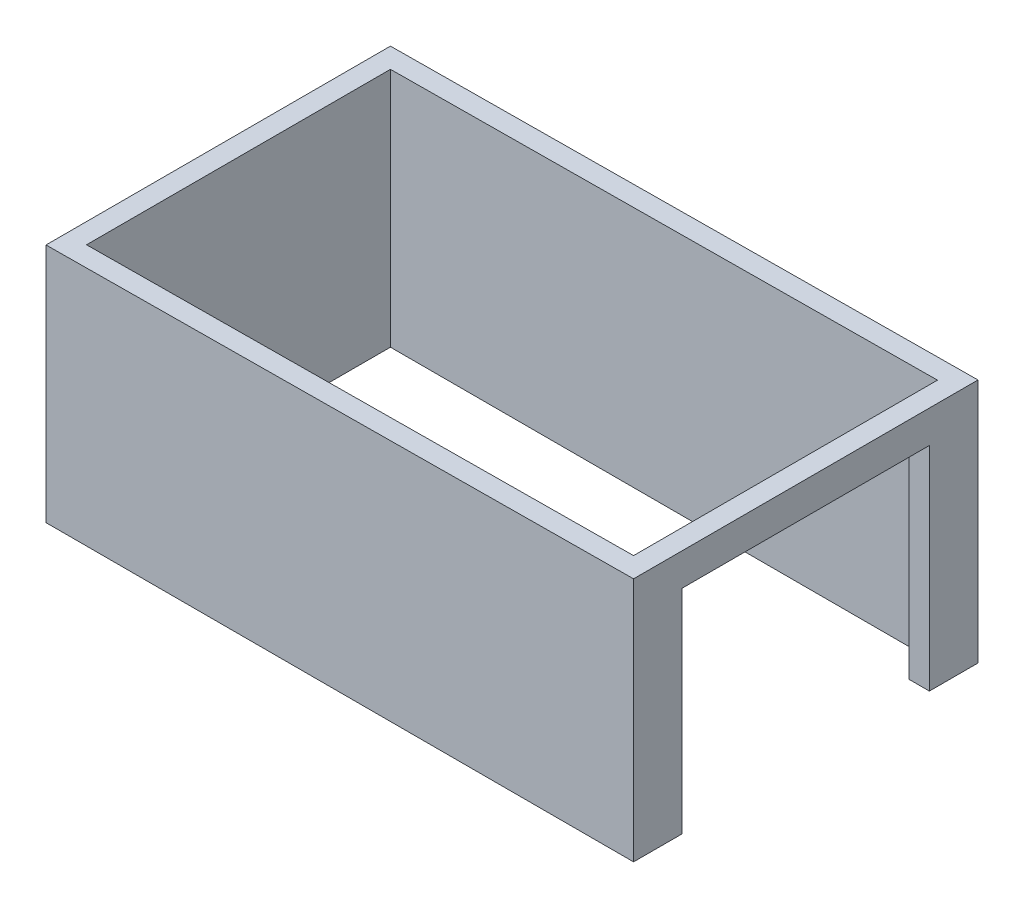
ISO-10303-21;
HEADER;
FILE_DESCRIPTION(('STEP AP214'),'2;1');
FILE_NAME('part.step','',(''),(''),'','','');
FILE_SCHEMA(('AUTOMOTIVE_DESIGN { 1 0 10303 214 1 1 1 1 }'));
ENDSEC;
DATA;
#1=APPLICATION_CONTEXT('core data for automotive mechanical design processes');
#2=APPLICATION_PROTOCOL_DEFINITION('international standard','automotive_design',2000,#1);
#3=PRODUCT_CONTEXT('',#1,'mechanical');
#4=PRODUCT('Part','Part','',(#3));
#5=PRODUCT_RELATED_PRODUCT_CATEGORY('part','',(#4));
#6=PRODUCT_DEFINITION_FORMATION('','',#4);
#7=PRODUCT_DEFINITION_CONTEXT('part definition',#1,'design');
#8=PRODUCT_DEFINITION('design','',#6,#7);
#9=PRODUCT_DEFINITION_SHAPE('','',#8);
#10=(LENGTH_UNIT() NAMED_UNIT(*) SI_UNIT(.MILLI.,.METRE.));
#11=(NAMED_UNIT(*) PLANE_ANGLE_UNIT() SI_UNIT($,.RADIAN.));
#12=(NAMED_UNIT(*) SI_UNIT($,.STERADIAN.) SOLID_ANGLE_UNIT());
#13=UNCERTAINTY_MEASURE_WITH_UNIT(LENGTH_MEASURE(1.E-05),#10,'distance_accuracy_value','');
#14=(GEOMETRIC_REPRESENTATION_CONTEXT(3) GLOBAL_UNCERTAINTY_ASSIGNED_CONTEXT((#13)) GLOBAL_UNIT_ASSIGNED_CONTEXT((#10,
#11,#12)) REPRESENTATION_CONTEXT('',''));
#15=CARTESIAN_POINT('',(0.,0.,0.));
#16=DIRECTION('',(0.,0.,1.));
#17=DIRECTION('',(1.,0.,0.));
#18=AXIS2_PLACEMENT_3D('',#15,#16,#17);
#19=CARTESIAN_POINT('',(0.,0.,0.));
#20=DIRECTION('',(0.,1.,0.));
#21=DIRECTION('',(0.,0.,1.));
#22=AXIS2_PLACEMENT_3D('',#19,#20,#21);
#23=PLANE('',#22);
#24=DIRECTION('',(0.,0.,-1.));
#25=VECTOR('',#24,1.);
#26=CARTESIAN_POINT('',(5600.,0.,0.));
#27=LINE('',#26,#25);
#28=CARTESIAN_POINT('',(5600.,0.,-2720.));
#29=VERTEX_POINT('',#28);
#30=CARTESIAN_POINT('',(5600.,0.,-3200.));
#31=VERTEX_POINT('',#30);
#32=EDGE_CURVE('E183',#29,#31,#27,.T.);
#33=ORIENTED_EDGE('',*,*,#32,.F.);
#34=DIRECTION('',(1.,0.,0.));
#35=VECTOR('',#34,1.);
#36=CARTESIAN_POINT('',(-200.001,0.,-2720.));
#37=LINE('',#36,#35);
#38=CARTESIAN_POINT('',(5400.,0.,-2720.));
#39=VERTEX_POINT('',#38);
#40=EDGE_CURVE('E211',#39,#29,#37,.T.);
#41=ORIENTED_EDGE('',*,*,#40,.F.);
#42=DIRECTION('',(0.,0.,-1.));
#43=VECTOR('',#42,1.);
#44=CARTESIAN_POINT('',(5400.,0.,0.));
#45=LINE('',#44,#43);
#46=CARTESIAN_POINT('',(5400.,0.,-3000.));
#47=VERTEX_POINT('',#46);
#48=EDGE_CURVE('E202',#39,#47,#45,.T.);
#49=ORIENTED_EDGE('',*,*,#48,.T.);
#50=DIRECTION('',(-1.,0.,0.));
#51=VECTOR('',#50,1.);
#52=CARTESIAN_POINT('',(0.,0.,-3000.));
#53=LINE('',#52,#51);
#54=CARTESIAN_POINT('',(0.,0.,-3000.));
#55=VERTEX_POINT('',#54);
#56=EDGE_CURVE('E196',#47,#55,#53,.T.);
#57=ORIENTED_EDGE('',*,*,#56,.T.);
#58=DIRECTION('',(0.,0.,1.));
#59=VECTOR('',#58,1.);
#60=CARTESIAN_POINT('',(0.,0.,0.));
#61=LINE('',#60,#59);
#62=CARTESIAN_POINT('',(0.,0.,0.));
#63=VERTEX_POINT('',#62);
#64=EDGE_CURVE('E206',#55,#63,#61,.T.);
#65=ORIENTED_EDGE('',*,*,#64,.T.);
#66=DIRECTION('',(1.,0.,0.));
#67=VECTOR('',#66,1.);
#68=CARTESIAN_POINT('',(0.,0.,0.));
#69=LINE('',#68,#67);
#70=CARTESIAN_POINT('',(5400.,0.,0.));
#71=VERTEX_POINT('',#70);
#72=EDGE_CURVE('E203',#63,#71,#69,.T.);
#73=ORIENTED_EDGE('',*,*,#72,.T.);
#74=CARTESIAN_POINT('',(5400.,0.,-280.));
#75=VERTEX_POINT('',#74);
#76=EDGE_CURVE('E199',#71,#75,#45,.T.);
#77=ORIENTED_EDGE('',*,*,#76,.T.);
#78=DIRECTION('',(1.,0.,0.));
#79=VECTOR('',#78,1.);
#80=CARTESIAN_POINT('',(-200.001,0.,-280.));
#81=LINE('',#80,#79);
#82=CARTESIAN_POINT('',(5600.,0.,-280.));
#83=VERTEX_POINT('',#82);
#84=EDGE_CURVE('E82',#75,#83,#81,.T.);
#85=ORIENTED_EDGE('',*,*,#84,.T.);
#86=CARTESIAN_POINT('',(5600.,0.,200.));
#87=VERTEX_POINT('',#86);
#88=EDGE_CURVE('E180',#87,#83,#27,.T.);
#89=ORIENTED_EDGE('',*,*,#88,.F.);
#90=DIRECTION('',(1.,0.,0.));
#91=VECTOR('',#90,1.);
#92=CARTESIAN_POINT('',(0.,0.,200.));
#93=LINE('',#92,#91);
#94=CARTESIAN_POINT('',(-200.,0.,200.));
#95=VERTEX_POINT('',#94);
#96=EDGE_CURVE('E184',#95,#87,#93,.T.);
#97=ORIENTED_EDGE('',*,*,#96,.F.);
#98=DIRECTION('',(0.,0.,1.));
#99=VECTOR('',#98,1.);
#100=CARTESIAN_POINT('',(-200.,0.,0.));
#101=LINE('',#100,#99);
#102=CARTESIAN_POINT('',(-200.,0.,-3200.));
#103=VERTEX_POINT('',#102);
#104=EDGE_CURVE('E168',#103,#95,#101,.T.);
#105=ORIENTED_EDGE('',*,*,#104,.F.);
#106=DIRECTION('',(-1.,0.,0.));
#107=VECTOR('',#106,1.);
#108=CARTESIAN_POINT('',(0.,0.,-3200.));
#109=LINE('',#108,#107);
#110=EDGE_CURVE('E177',#31,#103,#109,.T.);
#111=ORIENTED_EDGE('',*,*,#110,.F.);
#112=EDGE_LOOP('',(#33,#41,#49,#57,#65,#73,#77,#85,#89,#97,#105,#111));
#113=FACE_BOUND('',#112,.T.);
#114=ADVANCED_FACE('F60',(#113),#23,.F.);
#115=CARTESIAN_POINT('',(-200.,2420.,0.));
#116=DIRECTION('',(1.,0.,0.));
#117=DIRECTION('',(0.,0.,-1.));
#118=AXIS2_PLACEMENT_3D('',#115,#116,#117);
#119=PLANE('',#118);
#120=DIRECTION('',(0.,-1.,0.));
#121=VECTOR('',#120,1.);
#122=CARTESIAN_POINT('',(-200.,2420.,200.));
#123=LINE('',#122,#121);
#124=CARTESIAN_POINT('',(-200.,2374.,200.));
#125=VERTEX_POINT('',#124);
#126=EDGE_CURVE('E68',#125,#95,#123,.T.);
#127=ORIENTED_EDGE('',*,*,#126,.F.);
#128=DIRECTION('',(0.,0.,-1.));
#129=VECTOR('',#128,1.);
#130=CARTESIAN_POINT('',(-200.,2374.,200.));
#131=LINE('',#130,#129);
#132=CARTESIAN_POINT('',(-200.,2374.,-3200.));
#133=VERTEX_POINT('',#132);
#134=EDGE_CURVE('E147',#125,#133,#131,.T.);
#135=ORIENTED_EDGE('',*,*,#134,.T.);
#136=DIRECTION('',(0.,-1.,0.));
#137=VECTOR('',#136,1.);
#138=CARTESIAN_POINT('',(-200.,2420.,-3200.));
#139=LINE('',#138,#137);
#140=EDGE_CURVE('E174',#133,#103,#139,.T.);
#141=ORIENTED_EDGE('',*,*,#140,.T.);
#142=ORIENTED_EDGE('',*,*,#104,.T.);
#143=EDGE_LOOP('',(#127,#135,#141,#142));
#144=FACE_BOUND('',#143,.T.);
#145=ADVANCED_FACE('F62',(#144),#119,.F.);
#146=CARTESIAN_POINT('',(0.,2420.,200.));
#147=DIRECTION('',(0.,0.,-1.));
#148=DIRECTION('',(-1.,0.,0.));
#149=AXIS2_PLACEMENT_3D('',#146,#147,#148);
#150=PLANE('',#149);
#151=DIRECTION('',(0.,-1.,0.));
#152=VECTOR('',#151,1.);
#153=CARTESIAN_POINT('',(5600.,2420.,200.));
#154=LINE('',#153,#152);
#155=CARTESIAN_POINT('',(5600.,2420.,200.));
#156=VERTEX_POINT('',#155);
#157=EDGE_CURVE('E163',#156,#87,#154,.T.);
#158=ORIENTED_EDGE('',*,*,#157,.F.);
#159=DIRECTION('',(-0.999968550829654,-0.00793078505830412,0.));
#160=VECTOR('',#159,1.);
#161=CARTESIAN_POINT('',(-200.,2374.,200.));
#162=LINE('',#161,#160);
#163=EDGE_CURVE('E150',#156,#125,#162,.T.);
#164=ORIENTED_EDGE('',*,*,#163,.T.);
#165=ORIENTED_EDGE('',*,*,#126,.T.);
#166=ORIENTED_EDGE('',*,*,#96,.T.);
#167=EDGE_LOOP('',(#158,#164,#165,#166));
#168=FACE_BOUND('',#167,.T.);
#169=ADVANCED_FACE('F160',(#168),#150,.F.);
#170=CARTESIAN_POINT('',(5600.,2420.,0.));
#171=DIRECTION('',(-1.,0.,0.));
#172=DIRECTION('',(0.,0.,1.));
#173=AXIS2_PLACEMENT_3D('',#170,#171,#172);
#174=PLANE('',#173);
#175=DIRECTION('',(0.,0.,1.));
#176=VECTOR('',#175,1.);
#177=CARTESIAN_POINT('',(5600.,2100.,-280.));
#178=LINE('',#177,#176);
#179=CARTESIAN_POINT('',(5600.,2100.,-2720.));
#180=VERTEX_POINT('',#179);
#181=CARTESIAN_POINT('',(5600.,2100.,-280.));
#182=VERTEX_POINT('',#181);
#183=EDGE_CURVE('E212',#180,#182,#178,.T.);
#184=ORIENTED_EDGE('',*,*,#183,.F.);
#185=DIRECTION('',(0.,1.,0.));
#186=VECTOR('',#185,1.);
#187=CARTESIAN_POINT('',(5600.,0.,-2720.));
#188=LINE('',#187,#186);
#189=EDGE_CURVE('E219',#29,#180,#188,.T.);
#190=ORIENTED_EDGE('',*,*,#189,.F.);
#191=ORIENTED_EDGE('',*,*,#32,.T.);
#192=DIRECTION('',(0.,-1.,0.));
#193=VECTOR('',#192,1.);
#194=CARTESIAN_POINT('',(5600.,2420.,-3200.));
#195=LINE('',#194,#193);
#196=CARTESIAN_POINT('',(5600.,2420.,-3200.));
#197=VERTEX_POINT('',#196);
#198=EDGE_CURVE('E169',#197,#31,#195,.T.);
#199=ORIENTED_EDGE('',*,*,#198,.F.);
#200=DIRECTION('',(0.,0.,-1.));
#201=VECTOR('',#200,1.);
#202=CARTESIAN_POINT('',(5600.,2420.,0.));
#203=LINE('',#202,#201);
#204=EDGE_CURVE('E176',#156,#197,#203,.T.);
#205=ORIENTED_EDGE('',*,*,#204,.F.);
#206=ORIENTED_EDGE('',*,*,#157,.T.);
#207=ORIENTED_EDGE('',*,*,#88,.T.);
#208=DIRECTION('',(0.,-1.,0.));
#209=VECTOR('',#208,1.);
#210=CARTESIAN_POINT('',(5600.,0.,-280.));
#211=LINE('',#210,#209);
#212=EDGE_CURVE('E222',#182,#83,#211,.T.);
#213=ORIENTED_EDGE('',*,*,#212,.F.);
#214=EDGE_LOOP('',(#184,#190,#191,#199,#205,#206,#207,#213));
#215=FACE_BOUND('',#214,.T.);
#216=ADVANCED_FACE('F266',(#215),#174,.F.);
#217=CARTESIAN_POINT('',(0.,2420.,-3200.));
#218=DIRECTION('',(0.,0.,1.));
#219=DIRECTION('',(1.,0.,0.));
#220=AXIS2_PLACEMENT_3D('',#217,#218,#219);
#221=PLANE('',#220);
#222=ORIENTED_EDGE('',*,*,#140,.F.);
#223=DIRECTION('',(-0.999968550829654,-0.00793078505830412,0.));
#224=VECTOR('',#223,1.);
#225=CARTESIAN_POINT('',(-200.,2374.,-3200.));
#226=LINE('',#225,#224);
#227=EDGE_CURVE('E153',#197,#133,#226,.T.);
#228=ORIENTED_EDGE('',*,*,#227,.F.);
#229=ORIENTED_EDGE('',*,*,#198,.T.);
#230=ORIENTED_EDGE('',*,*,#110,.T.);
#231=EDGE_LOOP('',(#222,#228,#229,#230));
#232=FACE_BOUND('',#231,.T.);
#233=ADVANCED_FACE('F275',(#232),#221,.F.);
#234=CARTESIAN_POINT('',(0.,2420.,0.));
#235=DIRECTION('',(1.,0.,0.));
#236=DIRECTION('',(0.,0.,-1.));
#237=AXIS2_PLACEMENT_3D('',#234,#235,#236);
#238=PLANE('',#237);
#239=DIRECTION('',(0.,0.,-1.));
#240=VECTOR('',#239,1.);
#241=CARTESIAN_POINT('',(0.,2375.58620689655,0.));
#242=LINE('',#241,#240);
#243=CARTESIAN_POINT('',(0.,2375.58620689655,0.));
#244=VERTEX_POINT('',#243);
#245=CARTESIAN_POINT('',(0.,2375.58620689655,-3000.));
#246=VERTEX_POINT('',#245);
#247=EDGE_CURVE('E74',#244,#246,#242,.T.);
#248=ORIENTED_EDGE('',*,*,#247,.F.);
#249=DIRECTION('',(0.,-1.,0.));
#250=VECTOR('',#249,1.);
#251=CARTESIAN_POINT('',(0.,2420.,0.));
#252=LINE('',#251,#250);
#253=EDGE_CURVE('E187',#244,#63,#252,.T.);
#254=ORIENTED_EDGE('',*,*,#253,.T.);
#255=ORIENTED_EDGE('',*,*,#64,.F.);
#256=DIRECTION('',(0.,-1.,0.));
#257=VECTOR('',#256,1.);
#258=CARTESIAN_POINT('',(0.,2420.,-3000.));
#259=LINE('',#258,#257);
#260=EDGE_CURVE('E194',#246,#55,#259,.T.);
#261=ORIENTED_EDGE('',*,*,#260,.F.);
#262=EDGE_LOOP('',(#248,#254,#255,#261));
#263=FACE_BOUND('',#262,.T.);
#264=ADVANCED_FACE('F254',(#263),#238,.T.);
#265=CARTESIAN_POINT('',(0.,2420.,0.));
#266=DIRECTION('',(0.,0.,-1.));
#267=DIRECTION('',(-1.,0.,0.));
#268=AXIS2_PLACEMENT_3D('',#265,#266,#267);
#269=PLANE('',#268);
#270=DIRECTION('',(-0.999968550829655,-0.00793078505830412,0.));
#271=VECTOR('',#270,1.);
#272=CARTESIAN_POINT('',(0.352225169189712,2375.58900040651,0.));
#273=LINE('',#272,#271);
#274=CARTESIAN_POINT('',(5400.,2418.41379310345,0.));
#275=VERTEX_POINT('',#274);
#276=EDGE_CURVE('E233',#275,#244,#273,.T.);
#277=ORIENTED_EDGE('',*,*,#276,.F.);
#278=DIRECTION('',(0.,-1.,0.));
#279=VECTOR('',#278,1.);
#280=CARTESIAN_POINT('',(5400.,2420.,0.));
#281=LINE('',#280,#279);
#282=EDGE_CURVE('E190',#275,#71,#281,.T.);
#283=ORIENTED_EDGE('',*,*,#282,.T.);
#284=ORIENTED_EDGE('',*,*,#72,.F.);
#285=ORIENTED_EDGE('',*,*,#253,.F.);
#286=EDGE_LOOP('',(#277,#283,#284,#285));
#287=FACE_BOUND('',#286,.T.);
#288=ADVANCED_FACE('F243',(#287),#269,.T.);
#289=CARTESIAN_POINT('',(5400.,2420.,0.));
#290=DIRECTION('',(-1.,0.,0.));
#291=DIRECTION('',(0.,0.,1.));
#292=AXIS2_PLACEMENT_3D('',#289,#290,#291);
#293=PLANE('',#292);
#294=DIRECTION('',(0.,0.,1.));
#295=VECTOR('',#294,1.);
#296=CARTESIAN_POINT('',(5400.,2418.41379310345,0.));
#297=LINE('',#296,#295);
#298=CARTESIAN_POINT('',(5400.,2418.41379310345,-3000.));
#299=VERTEX_POINT('',#298);
#300=EDGE_CURVE('E157',#299,#275,#297,.T.);
#301=ORIENTED_EDGE('',*,*,#300,.F.);
#302=DIRECTION('',(0.,-1.,0.));
#303=VECTOR('',#302,1.);
#304=CARTESIAN_POINT('',(5400.,2420.,-3000.));
#305=LINE('',#304,#303);
#306=EDGE_CURVE('E192',#299,#47,#305,.T.);
#307=ORIENTED_EDGE('',*,*,#306,.T.);
#308=ORIENTED_EDGE('',*,*,#48,.F.);
#309=DIRECTION('',(0.,1.,0.));
#310=VECTOR('',#309,1.);
#311=CARTESIAN_POINT('',(5400.,0.,-2720.));
#312=LINE('',#311,#310);
#313=CARTESIAN_POINT('',(5400.,2100.,-2720.));
#314=VERTEX_POINT('',#313);
#315=EDGE_CURVE('E229',#39,#314,#312,.T.);
#316=ORIENTED_EDGE('',*,*,#315,.T.);
#317=DIRECTION('',(0.,0.,1.));
#318=VECTOR('',#317,1.);
#319=CARTESIAN_POINT('',(5400.,2100.,-280.));
#320=LINE('',#319,#318);
#321=CARTESIAN_POINT('',(5400.,2100.,-280.));
#322=VERTEX_POINT('',#321);
#323=EDGE_CURVE('E226',#314,#322,#320,.T.);
#324=ORIENTED_EDGE('',*,*,#323,.T.);
#325=DIRECTION('',(0.,-1.,0.));
#326=VECTOR('',#325,1.);
#327=CARTESIAN_POINT('',(5400.,0.,-280.));
#328=LINE('',#327,#326);
#329=EDGE_CURVE('E224',#322,#75,#328,.T.);
#330=ORIENTED_EDGE('',*,*,#329,.T.);
#331=ORIENTED_EDGE('',*,*,#76,.F.);
#332=ORIENTED_EDGE('',*,*,#282,.F.);
#333=EDGE_LOOP('',(#301,#307,#308,#316,#324,#330,#331,#332));
#334=FACE_BOUND('',#333,.T.);
#335=ADVANCED_FACE('F246',(#334),#293,.T.);
#336=CARTESIAN_POINT('',(0.,2420.,-3000.));
#337=DIRECTION('',(0.,0.,1.));
#338=DIRECTION('',(1.,0.,0.));
#339=AXIS2_PLACEMENT_3D('',#336,#337,#338);
#340=PLANE('',#339);
#341=DIRECTION('',(0.999968550829655,0.00793078505830412,0.));
#342=VECTOR('',#341,1.);
#343=CARTESIAN_POINT('',(0.352225169189712,2375.58900040651,-3000.));
#344=LINE('',#343,#342);
#345=EDGE_CURVE('E12',#246,#299,#344,.T.);
#346=ORIENTED_EDGE('',*,*,#345,.F.);
#347=ORIENTED_EDGE('',*,*,#260,.T.);
#348=ORIENTED_EDGE('',*,*,#56,.F.);
#349=ORIENTED_EDGE('',*,*,#306,.F.);
#350=EDGE_LOOP('',(#346,#347,#348,#349));
#351=FACE_BOUND('',#350,.T.);
#352=ADVANCED_FACE('F256',(#351),#340,.T.);
#353=CARTESIAN_POINT('',(-200.001,0.,-2720.));
#354=DIRECTION('',(0.,0.,-1.));
#355=DIRECTION('',(-1.,0.,0.));
#356=AXIS2_PLACEMENT_3D('',#353,#354,#355);
#357=PLANE('',#356);
#358=ORIENTED_EDGE('',*,*,#40,.T.);
#359=ORIENTED_EDGE('',*,*,#189,.T.);
#360=DIRECTION('',(1.,0.,0.));
#361=VECTOR('',#360,1.);
#362=CARTESIAN_POINT('',(-200.001,2100.,-2720.));
#363=LINE('',#362,#361);
#364=EDGE_CURVE('E214',#314,#180,#363,.T.);
#365=ORIENTED_EDGE('',*,*,#364,.F.);
#366=ORIENTED_EDGE('',*,*,#315,.F.);
#367=EDGE_LOOP('',(#358,#359,#365,#366));
#368=FACE_BOUND('',#367,.T.);
#369=ADVANCED_FACE('F262',(#368),#357,.F.);
#370=CARTESIAN_POINT('',(-200.001,2100.,-280.));
#371=DIRECTION('',(0.,1.,0.));
#372=DIRECTION('',(0.,0.,1.));
#373=AXIS2_PLACEMENT_3D('',#370,#371,#372);
#374=PLANE('',#373);
#375=ORIENTED_EDGE('',*,*,#364,.T.);
#376=ORIENTED_EDGE('',*,*,#183,.T.);
#377=DIRECTION('',(1.,0.,0.));
#378=VECTOR('',#377,1.);
#379=CARTESIAN_POINT('',(-200.001,2100.,-280.));
#380=LINE('',#379,#378);
#381=EDGE_CURVE('E209',#322,#182,#380,.T.);
#382=ORIENTED_EDGE('',*,*,#381,.F.);
#383=ORIENTED_EDGE('',*,*,#323,.F.);
#384=EDGE_LOOP('',(#375,#376,#382,#383));
#385=FACE_BOUND('',#384,.T.);
#386=ADVANCED_FACE('F271',(#385),#374,.F.);
#387=CARTESIAN_POINT('',(-200.001,0.,-280.));
#388=DIRECTION('',(0.,0.,1.));
#389=DIRECTION('',(1.,0.,0.));
#390=AXIS2_PLACEMENT_3D('',#387,#388,#389);
#391=PLANE('',#390);
#392=ORIENTED_EDGE('',*,*,#381,.T.);
#393=ORIENTED_EDGE('',*,*,#212,.T.);
#394=ORIENTED_EDGE('',*,*,#84,.F.);
#395=ORIENTED_EDGE('',*,*,#329,.F.);
#396=EDGE_LOOP('',(#392,#393,#394,#395));
#397=FACE_BOUND('',#396,.T.);
#398=ADVANCED_FACE('F272',(#397),#391,.F.);
#399=CARTESIAN_POINT('',(-200.,2374.,200.));
#400=DIRECTION('',(0.00793078505830412,-0.999968550829654,0.));
#401=DIRECTION('',(0.999968550829655,0.00793078505830412,0.));
#402=AXIS2_PLACEMENT_3D('',#399,#400,#401);
#403=PLANE('',#402);
#404=ORIENTED_EDGE('',*,*,#247,.T.);
#405=ORIENTED_EDGE('',*,*,#345,.T.);
#406=ORIENTED_EDGE('',*,*,#300,.T.);
#407=ORIENTED_EDGE('',*,*,#276,.T.);
#408=EDGE_LOOP('',(#404,#405,#406,#407));
#409=FACE_BOUND('',#408,.T.);
#410=ORIENTED_EDGE('',*,*,#227,.T.);
#411=ORIENTED_EDGE('',*,*,#134,.F.);
#412=ORIENTED_EDGE('',*,*,#163,.F.);
#413=ORIENTED_EDGE('',*,*,#204,.T.);
#414=EDGE_LOOP('',(#410,#411,#412,#413));
#415=FACE_BOUND('',#414,.T.);
#416=ADVANCED_FACE('F149',(#409,#415),#403,.F.);
#417=CLOSED_SHELL('',(#114,#145,#169,#216,#233,#264,#288,#335,#352,#369,#386,#398,#416));
#418=MANIFOLD_SOLID_BREP('B2',#417);
#419=ADVANCED_BREP_SHAPE_REPRESENTATION('',(#18,#418),#14);
#420=SHAPE_DEFINITION_REPRESENTATION(#9,#419);
ENDSEC;
END-ISO-10303-21;
